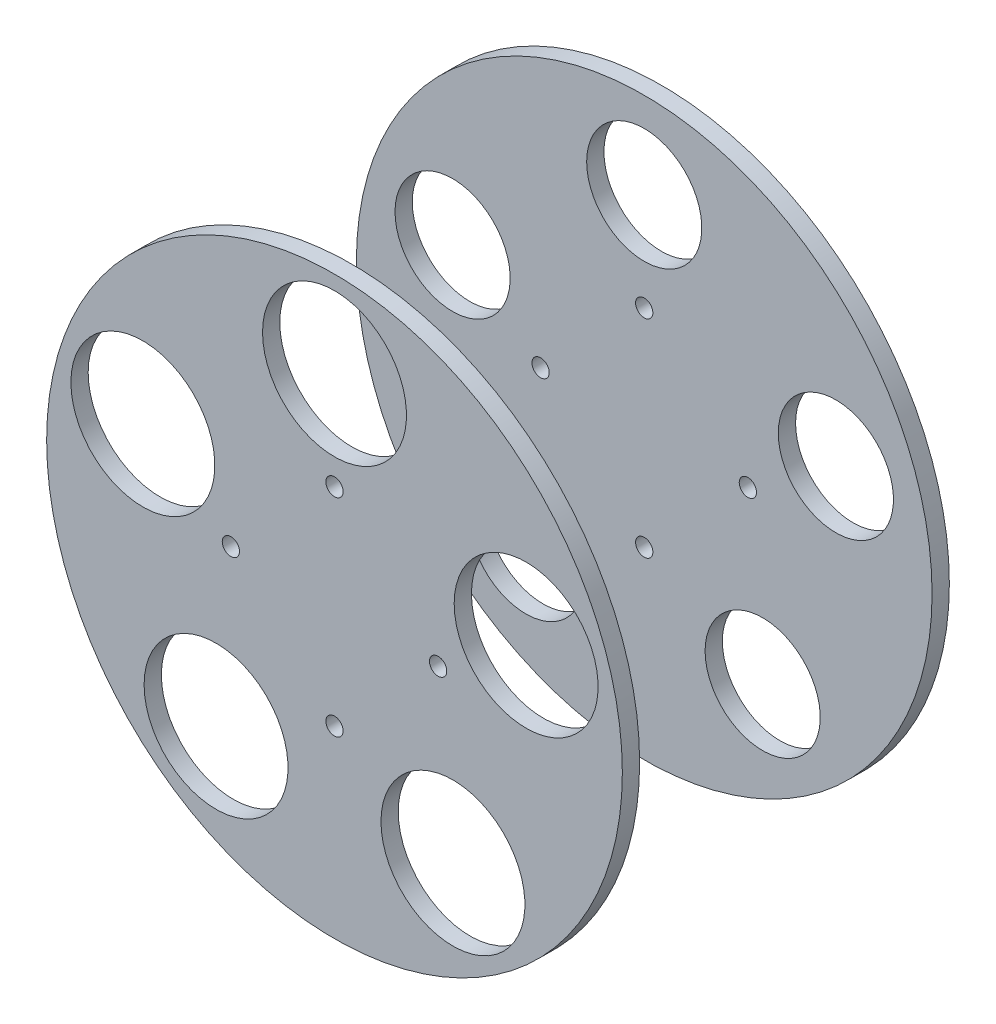
ISO-10303-21;
HEADER;
FILE_DESCRIPTION(('STEP AP214'),'2;1');
FILE_NAME('part.step','',(''),(''),'','','');
FILE_SCHEMA(('AUTOMOTIVE_DESIGN { 1 0 10303 214 1 1 1 1 }'));
ENDSEC;
DATA;
#1=APPLICATION_CONTEXT('core data for automotive mechanical design processes');
#2=APPLICATION_PROTOCOL_DEFINITION('international standard','automotive_design',2000,#1);
#3=PRODUCT_CONTEXT('',#1,'mechanical');
#4=PRODUCT('Part','Part','',(#3));
#5=PRODUCT_RELATED_PRODUCT_CATEGORY('part','',(#4));
#6=PRODUCT_DEFINITION_FORMATION('','',#4);
#7=PRODUCT_DEFINITION_CONTEXT('part definition',#1,'design');
#8=PRODUCT_DEFINITION('design','',#6,#7);
#9=PRODUCT_DEFINITION_SHAPE('','',#8);
#10=(LENGTH_UNIT() NAMED_UNIT(*) SI_UNIT(.MILLI.,.METRE.));
#11=(NAMED_UNIT(*) PLANE_ANGLE_UNIT() SI_UNIT($,.RADIAN.));
#12=(NAMED_UNIT(*) SI_UNIT($,.STERADIAN.) SOLID_ANGLE_UNIT());
#13=UNCERTAINTY_MEASURE_WITH_UNIT(LENGTH_MEASURE(1.E-05),#10,'distance_accuracy_value','');
#14=(GEOMETRIC_REPRESENTATION_CONTEXT(3) GLOBAL_UNCERTAINTY_ASSIGNED_CONTEXT((#13)) GLOBAL_UNIT_ASSIGNED_CONTEXT((#10,
#11,#12)) REPRESENTATION_CONTEXT('',''));
#15=CARTESIAN_POINT('',(0.,0.,0.));
#16=DIRECTION('',(0.,0.,1.));
#17=DIRECTION('',(1.,0.,0.));
#18=AXIS2_PLACEMENT_3D('',#15,#16,#17);
#19=CARTESIAN_POINT('',(0.,0.,0.));
#20=DIRECTION('',(0.,0.,1.));
#21=DIRECTION('',(1.,0.,0.));
#22=AXIS2_PLACEMENT_3D('',#19,#20,#21);
#23=PLANE('',#22);
#24=CARTESIAN_POINT('',(0.,18.,0.));
#25=DIRECTION('',(0.,0.,-1.));
#26=DIRECTION('',(1.,0.,0.));
#27=AXIS2_PLACEMENT_3D('',#24,#25,#26);
#28=CIRCLE('',#27,1.5);
#29=CARTESIAN_POINT('',(-1.5,18.,0.));
#30=VERTEX_POINT('',#29);
#31=EDGE_CURVE('P0_E125',#30,#30,#28,.T.);
#32=ORIENTED_EDGE('',*,*,#31,.F.);
#33=EDGE_LOOP('',(#32));
#34=FACE_BOUND('',#33,.T.);
#35=CARTESIAN_POINT('',(0.,-18.,0.));
#36=DIRECTION('',(0.,0.,-1.));
#37=DIRECTION('',(1.,0.,0.));
#38=AXIS2_PLACEMENT_3D('',#35,#36,#37);
#39=CIRCLE('',#38,1.5);
#40=CARTESIAN_POINT('',(-1.5,-18.,0.));
#41=VERTEX_POINT('',#40);
#42=EDGE_CURVE('P0_E136',#41,#41,#39,.T.);
#43=ORIENTED_EDGE('',*,*,#42,.F.);
#44=EDGE_LOOP('',(#43));
#45=FACE_BOUND('',#44,.T.);
#46=CARTESIAN_POINT('',(33.2869780703304,10.8155948031231,0.));
#47=DIRECTION('',(0.,0.,-1.));
#48=DIRECTION('',(1.,0.,0.));
#49=AXIS2_PLACEMENT_3D('',#46,#47,#48);
#50=CIRCLE('',#49,12.5);
#51=CARTESIAN_POINT('',(20.7869780703304,10.8155948031231,0.));
#52=VERTEX_POINT('',#51);
#53=EDGE_CURVE('P0_E157',#52,#52,#50,.T.);
#54=ORIENTED_EDGE('',*,*,#53,.F.);
#55=EDGE_LOOP('',(#54));
#56=FACE_BOUND('',#55,.T.);
#57=CARTESIAN_POINT('',(20.5724838302366,-28.3155948031232,0.));
#58=DIRECTION('',(0.,0.,-1.));
#59=DIRECTION('',(1.,0.,0.));
#60=AXIS2_PLACEMENT_3D('',#57,#58,#59);
#61=CIRCLE('',#60,12.5);
#62=CARTESIAN_POINT('',(8.07248383023655,-28.3155948031232,0.));
#63=VERTEX_POINT('',#62);
#64=EDGE_CURVE('P0_E204',#63,#63,#61,.T.);
#65=ORIENTED_EDGE('',*,*,#64,.F.);
#66=EDGE_LOOP('',(#65));
#67=FACE_BOUND('',#66,.T.);
#68=CARTESIAN_POINT('',(18.,0.,0.));
#69=DIRECTION('',(0.,0.,-1.));
#70=DIRECTION('',(1.,0.,0.));
#71=AXIS2_PLACEMENT_3D('',#68,#69,#70);
#72=CIRCLE('',#71,1.5);
#73=CARTESIAN_POINT('',(16.5,0.,0.));
#74=VERTEX_POINT('',#73);
#75=EDGE_CURVE('P0_E80',#74,#74,#72,.T.);
#76=ORIENTED_EDGE('',*,*,#75,.F.);
#77=EDGE_LOOP('',(#76));
#78=FACE_BOUND('',#77,.T.);
#79=CARTESIAN_POINT('',(-18.,0.,0.));
#80=DIRECTION('',(0.,0.,-1.));
#81=DIRECTION('',(1.,0.,0.));
#82=AXIS2_PLACEMENT_3D('',#79,#80,#81);
#83=CIRCLE('',#82,1.5);
#84=CARTESIAN_POINT('',(-19.5,0.,0.));
#85=VERTEX_POINT('',#84);
#86=EDGE_CURVE('P0_E178',#85,#85,#83,.T.);
#87=ORIENTED_EDGE('',*,*,#86,.F.);
#88=EDGE_LOOP('',(#87));
#89=FACE_BOUND('',#88,.T.);
#90=CARTESIAN_POINT('',(-20.5724838302366,-28.3155948031232,0.));
#91=DIRECTION('',(0.,0.,-1.));
#92=DIRECTION('',(1.,0.,0.));
#93=AXIS2_PLACEMENT_3D('',#90,#91,#92);
#94=CIRCLE('',#93,12.5);
#95=CARTESIAN_POINT('',(-33.0724838302366,-28.3155948031232,0.));
#96=VERTEX_POINT('',#95);
#97=EDGE_CURVE('P0_E161',#96,#96,#94,.T.);
#98=ORIENTED_EDGE('',*,*,#97,.F.);
#99=EDGE_LOOP('',(#98));
#100=FACE_BOUND('',#99,.T.);
#101=CARTESIAN_POINT('',(-33.2869780703304,10.8155948031232,0.));
#102=DIRECTION('',(0.,0.,-1.));
#103=DIRECTION('',(1.,0.,0.));
#104=AXIS2_PLACEMENT_3D('',#101,#102,#103);
#105=CIRCLE('',#104,12.5);
#106=CARTESIAN_POINT('',(-45.7869780703304,10.8155948031232,0.));
#107=VERTEX_POINT('',#106);
#108=EDGE_CURVE('P0_E104',#107,#107,#105,.T.);
#109=ORIENTED_EDGE('',*,*,#108,.F.);
#110=EDGE_LOOP('',(#109));
#111=FACE_BOUND('',#110,.T.);
#112=CARTESIAN_POINT('',(0.,35.,0.));
#113=DIRECTION('',(0.,0.,-1.));
#114=DIRECTION('',(1.,0.,0.));
#115=AXIS2_PLACEMENT_3D('',#112,#113,#114);
#116=CIRCLE('',#115,12.5);
#117=CARTESIAN_POINT('',(-12.5,35.,0.));
#118=VERTEX_POINT('',#117);
#119=EDGE_CURVE('P0_E164',#118,#118,#116,.T.);
#120=ORIENTED_EDGE('',*,*,#119,.F.);
#121=EDGE_LOOP('',(#120));
#122=FACE_BOUND('',#121,.T.);
#123=CARTESIAN_POINT('',(0.,0.,0.));
#124=DIRECTION('',(0.,0.,1.));
#125=DIRECTION('',(1.,0.,0.));
#126=AXIS2_PLACEMENT_3D('',#123,#124,#125);
#127=CIRCLE('',#126,50.);
#128=CARTESIAN_POINT('',(-50.,0.,0.));
#129=VERTEX_POINT('',#128);
#130=EDGE_CURVE('P0_E11',#129,#129,#127,.T.);
#131=ORIENTED_EDGE('',*,*,#130,.F.);
#132=EDGE_LOOP('',(#131));
#133=FACE_BOUND('',#132,.T.);
#134=ADVANCED_FACE('P0_F17',(#34,#45,#56,#67,#78,#89,#100,#111,#122,#133),#23,.F.);
#135=CARTESIAN_POINT('',(0.,0.,3.));
#136=DIRECTION('',(0.,0.,1.));
#137=DIRECTION('',(1.,0.,0.));
#138=AXIS2_PLACEMENT_3D('',#135,#136,#137);
#139=PLANE('',#138);
#140=CARTESIAN_POINT('',(0.,18.,3.));
#141=DIRECTION('',(0.,0.,-1.));
#142=DIRECTION('',(1.,0.,0.));
#143=AXIS2_PLACEMENT_3D('',#140,#141,#142);
#144=CIRCLE('',#143,1.5);
#145=CARTESIAN_POINT('',(-1.5,18.,3.));
#146=VERTEX_POINT('',#145);
#147=EDGE_CURVE('P0_E214',#146,#146,#144,.T.);
#148=ORIENTED_EDGE('',*,*,#147,.T.);
#149=EDGE_LOOP('',(#148));
#150=FACE_BOUND('',#149,.T.);
#151=CARTESIAN_POINT('',(0.,-18.,3.));
#152=DIRECTION('',(0.,0.,-1.));
#153=DIRECTION('',(1.,0.,0.));
#154=AXIS2_PLACEMENT_3D('',#151,#152,#153);
#155=CIRCLE('',#154,1.5);
#156=CARTESIAN_POINT('',(-1.5,-18.,3.));
#157=VERTEX_POINT('',#156);
#158=EDGE_CURVE('P0_E134',#157,#157,#155,.T.);
#159=ORIENTED_EDGE('',*,*,#158,.T.);
#160=EDGE_LOOP('',(#159));
#161=FACE_BOUND('',#160,.T.);
#162=CARTESIAN_POINT('',(33.2869780703304,10.8155948031231,3.));
#163=DIRECTION('',(0.,0.,-1.));
#164=DIRECTION('',(1.,0.,0.));
#165=AXIS2_PLACEMENT_3D('',#162,#163,#164);
#166=CIRCLE('',#165,12.5);
#167=CARTESIAN_POINT('',(20.7869780703304,10.8155948031231,3.));
#168=VERTEX_POINT('',#167);
#169=EDGE_CURVE('P0_E189',#168,#168,#166,.T.);
#170=ORIENTED_EDGE('',*,*,#169,.T.);
#171=EDGE_LOOP('',(#170));
#172=FACE_BOUND('',#171,.T.);
#173=CARTESIAN_POINT('',(20.5724838302366,-28.3155948031232,3.));
#174=DIRECTION('',(0.,0.,-1.));
#175=DIRECTION('',(1.,0.,0.));
#176=AXIS2_PLACEMENT_3D('',#173,#174,#175);
#177=CIRCLE('',#176,12.5);
#178=CARTESIAN_POINT('',(8.07248383023655,-28.3155948031232,3.));
#179=VERTEX_POINT('',#178);
#180=EDGE_CURVE('P0_E153',#179,#179,#177,.T.);
#181=ORIENTED_EDGE('',*,*,#180,.T.);
#182=EDGE_LOOP('',(#181));
#183=FACE_BOUND('',#182,.T.);
#184=CARTESIAN_POINT('',(18.,0.,3.));
#185=DIRECTION('',(0.,0.,-1.));
#186=DIRECTION('',(1.,0.,0.));
#187=AXIS2_PLACEMENT_3D('',#184,#185,#186);
#188=CIRCLE('',#187,1.5);
#189=CARTESIAN_POINT('',(16.5,0.,3.));
#190=VERTEX_POINT('',#189);
#191=EDGE_CURVE('P0_E207',#190,#190,#188,.T.);
#192=ORIENTED_EDGE('',*,*,#191,.T.);
#193=EDGE_LOOP('',(#192));
#194=FACE_BOUND('',#193,.T.);
#195=CARTESIAN_POINT('',(-18.,0.,3.));
#196=DIRECTION('',(0.,0.,-1.));
#197=DIRECTION('',(1.,0.,0.));
#198=AXIS2_PLACEMENT_3D('',#195,#196,#197);
#199=CIRCLE('',#198,1.5);
#200=CARTESIAN_POINT('',(-19.5,0.,3.));
#201=VERTEX_POINT('',#200);
#202=EDGE_CURVE('P0_E179',#201,#201,#199,.T.);
#203=ORIENTED_EDGE('',*,*,#202,.T.);
#204=EDGE_LOOP('',(#203));
#205=FACE_BOUND('',#204,.T.);
#206=CARTESIAN_POINT('',(-20.5724838302366,-28.3155948031232,3.));
#207=DIRECTION('',(0.,0.,-1.));
#208=DIRECTION('',(1.,0.,0.));
#209=AXIS2_PLACEMENT_3D('',#206,#207,#208);
#210=CIRCLE('',#209,12.5);
#211=CARTESIAN_POINT('',(-33.0724838302366,-28.3155948031231,3.));
#212=VERTEX_POINT('',#211);
#213=EDGE_CURVE('P0_E162',#212,#212,#210,.T.);
#214=ORIENTED_EDGE('',*,*,#213,.T.);
#215=EDGE_LOOP('',(#214));
#216=FACE_BOUND('',#215,.T.);
#217=CARTESIAN_POINT('',(-33.2869780703304,10.8155948031232,3.));
#218=DIRECTION('',(0.,0.,-1.));
#219=DIRECTION('',(1.,0.,0.));
#220=AXIS2_PLACEMENT_3D('',#217,#218,#219);
#221=CIRCLE('',#220,12.5);
#222=CARTESIAN_POINT('',(-45.7869780703304,10.8155948031232,3.));
#223=VERTEX_POINT('',#222);
#224=EDGE_CURVE('P0_E173',#223,#223,#221,.T.);
#225=ORIENTED_EDGE('',*,*,#224,.T.);
#226=EDGE_LOOP('',(#225));
#227=FACE_BOUND('',#226,.T.);
#228=CARTESIAN_POINT('',(0.,35.,3.));
#229=DIRECTION('',(0.,0.,-1.));
#230=DIRECTION('',(1.,0.,0.));
#231=AXIS2_PLACEMENT_3D('',#228,#229,#230);
#232=CIRCLE('',#231,12.5);
#233=CARTESIAN_POINT('',(-12.5,35.,3.));
#234=VERTEX_POINT('',#233);
#235=EDGE_CURVE('P0_E185',#234,#234,#232,.T.);
#236=ORIENTED_EDGE('',*,*,#235,.T.);
#237=EDGE_LOOP('',(#236));
#238=FACE_BOUND('',#237,.T.);
#239=CARTESIAN_POINT('',(0.,0.,3.));
#240=DIRECTION('',(0.,0.,1.));
#241=DIRECTION('',(1.,0.,0.));
#242=AXIS2_PLACEMENT_3D('',#239,#240,#241);
#243=CIRCLE('',#242,50.);
#244=CARTESIAN_POINT('',(-50.,0.,3.));
#245=VERTEX_POINT('',#244);
#246=EDGE_CURVE('P0_E167',#245,#245,#243,.T.);
#247=ORIENTED_EDGE('',*,*,#246,.T.);
#248=EDGE_LOOP('',(#247));
#249=FACE_BOUND('',#248,.T.);
#250=ADVANCED_FACE('P0_F140',(#150,#161,#172,#183,#194,#205,#216,#227,#238,#249),#139,.T.);
#251=CARTESIAN_POINT('',(0.,0.,0.));
#252=DIRECTION('',(0.,0.,1.));
#253=DIRECTION('',(1.,0.,0.));
#254=AXIS2_PLACEMENT_3D('',#251,#252,#253);
#255=CYLINDRICAL_SURFACE('',#254,50.);
#256=ORIENTED_EDGE('',*,*,#246,.F.);
#257=DIRECTION('',(0.,0.,-1.));
#258=VECTOR('',#257,1.);
#259=CARTESIAN_POINT('',(-50.,0.,0.));
#260=LINE('',#259,#258);
#261=EDGE_CURVE('P0_E28',#245,#129,#260,.T.);
#262=ORIENTED_EDGE('',*,*,#261,.T.);
#263=ORIENTED_EDGE('',*,*,#130,.T.);
#264=ORIENTED_EDGE('',*,*,#261,.F.);
#265=EDGE_LOOP('',(#256,#262,#263,#264));
#266=FACE_BOUND('',#265,.T.);
#267=ADVANCED_FACE('P0_F240',(#266),#255,.T.);
#268=CARTESIAN_POINT('',(0.,35.,0.));
#269=DIRECTION('',(0.,0.,1.));
#270=DIRECTION('',(1.,0.,0.));
#271=AXIS2_PLACEMENT_3D('',#268,#269,#270);
#272=CYLINDRICAL_SURFACE('',#271,12.5);
#273=ORIENTED_EDGE('',*,*,#235,.F.);
#274=DIRECTION('',(0.,0.,-1.));
#275=VECTOR('',#274,1.);
#276=CARTESIAN_POINT('',(-12.5,35.,0.));
#277=LINE('',#276,#275);
#278=EDGE_CURVE('P0_E93',#234,#118,#277,.T.);
#279=ORIENTED_EDGE('',*,*,#278,.T.);
#280=ORIENTED_EDGE('',*,*,#119,.T.);
#281=ORIENTED_EDGE('',*,*,#278,.F.);
#282=EDGE_LOOP('',(#273,#279,#280,#281));
#283=FACE_BOUND('',#282,.T.);
#284=ADVANCED_FACE('P0_F19',(#283),#272,.F.);
#285=CARTESIAN_POINT('',(-33.2869780703304,10.8155948031232,0.));
#286=DIRECTION('',(0.,0.,1.));
#287=DIRECTION('',(1.,0.,0.));
#288=AXIS2_PLACEMENT_3D('',#285,#286,#287);
#289=CYLINDRICAL_SURFACE('',#288,12.5);
#290=ORIENTED_EDGE('',*,*,#224,.F.);
#291=DIRECTION('',(0.,0.,-1.));
#292=VECTOR('',#291,1.);
#293=CARTESIAN_POINT('',(-45.7869780703304,10.8155948031232,0.));
#294=LINE('',#293,#292);
#295=EDGE_CURVE('P0_E186',#223,#107,#294,.T.);
#296=ORIENTED_EDGE('',*,*,#295,.T.);
#297=ORIENTED_EDGE('',*,*,#108,.T.);
#298=ORIENTED_EDGE('',*,*,#295,.F.);
#299=EDGE_LOOP('',(#290,#296,#297,#298));
#300=FACE_BOUND('',#299,.T.);
#301=ADVANCED_FACE('P0_F246',(#300),#289,.F.);
#302=CARTESIAN_POINT('',(-20.5724838302366,-28.3155948031232,0.));
#303=DIRECTION('',(0.,0.,1.));
#304=DIRECTION('',(1.,0.,0.));
#305=AXIS2_PLACEMENT_3D('',#302,#303,#304);
#306=CYLINDRICAL_SURFACE('',#305,12.5);
#307=ORIENTED_EDGE('',*,*,#213,.F.);
#308=DIRECTION('',(0.,0.,-1.));
#309=VECTOR('',#308,1.);
#310=CARTESIAN_POINT('',(-33.0724838302366,-28.3155948031232,0.));
#311=LINE('',#310,#309);
#312=EDGE_CURVE('P0_E158',#212,#96,#311,.T.);
#313=ORIENTED_EDGE('',*,*,#312,.T.);
#314=ORIENTED_EDGE('',*,*,#97,.T.);
#315=ORIENTED_EDGE('',*,*,#312,.F.);
#316=EDGE_LOOP('',(#307,#313,#314,#315));
#317=FACE_BOUND('',#316,.T.);
#318=ADVANCED_FACE('P0_F249',(#317),#306,.F.);
#319=CARTESIAN_POINT('',(-18.,0.,0.));
#320=DIRECTION('',(0.,0.,1.));
#321=DIRECTION('',(1.,0.,0.));
#322=AXIS2_PLACEMENT_3D('',#319,#320,#321);
#323=CYLINDRICAL_SURFACE('',#322,1.5);
#324=ORIENTED_EDGE('',*,*,#202,.F.);
#325=DIRECTION('',(0.,0.,-1.));
#326=VECTOR('',#325,1.);
#327=CARTESIAN_POINT('',(-19.5,0.,0.));
#328=LINE('',#327,#326);
#329=EDGE_CURVE('P0_E174',#201,#85,#328,.T.);
#330=ORIENTED_EDGE('',*,*,#329,.T.);
#331=ORIENTED_EDGE('',*,*,#86,.T.);
#332=ORIENTED_EDGE('',*,*,#329,.F.);
#333=EDGE_LOOP('',(#324,#330,#331,#332));
#334=FACE_BOUND('',#333,.T.);
#335=ADVANCED_FACE('P0_F243',(#334),#323,.F.);
#336=CARTESIAN_POINT('',(18.,0.,0.));
#337=DIRECTION('',(0.,0.,1.));
#338=DIRECTION('',(1.,0.,0.));
#339=AXIS2_PLACEMENT_3D('',#336,#337,#338);
#340=CYLINDRICAL_SURFACE('',#339,1.5);
#341=ORIENTED_EDGE('',*,*,#191,.F.);
#342=DIRECTION('',(0.,0.,-1.));
#343=VECTOR('',#342,1.);
#344=CARTESIAN_POINT('',(16.5,0.,0.));
#345=LINE('',#344,#343);
#346=EDGE_CURVE('P0_E21',#190,#74,#345,.T.);
#347=ORIENTED_EDGE('',*,*,#346,.T.);
#348=ORIENTED_EDGE('',*,*,#75,.T.);
#349=ORIENTED_EDGE('',*,*,#346,.F.);
#350=EDGE_LOOP('',(#341,#347,#348,#349));
#351=FACE_BOUND('',#350,.T.);
#352=ADVANCED_FACE('P0_F250',(#351),#340,.F.);
#353=CARTESIAN_POINT('',(20.5724838302366,-28.3155948031232,0.));
#354=DIRECTION('',(0.,0.,1.));
#355=DIRECTION('',(1.,0.,0.));
#356=AXIS2_PLACEMENT_3D('',#353,#354,#355);
#357=CYLINDRICAL_SURFACE('',#356,12.5);
#358=ORIENTED_EDGE('',*,*,#180,.F.);
#359=DIRECTION('',(0.,0.,-1.));
#360=VECTOR('',#359,1.);
#361=CARTESIAN_POINT('',(8.07248383023655,-28.3155948031232,0.));
#362=LINE('',#361,#360);
#363=EDGE_CURVE('P0_E156',#179,#63,#362,.T.);
#364=ORIENTED_EDGE('',*,*,#363,.T.);
#365=ORIENTED_EDGE('',*,*,#64,.T.);
#366=ORIENTED_EDGE('',*,*,#363,.F.);
#367=EDGE_LOOP('',(#358,#364,#365,#366));
#368=FACE_BOUND('',#367,.T.);
#369=ADVANCED_FACE('P0_F252',(#368),#357,.F.);
#370=CARTESIAN_POINT('',(33.2869780703304,10.8155948031231,0.));
#371=DIRECTION('',(0.,0.,1.));
#372=DIRECTION('',(1.,0.,0.));
#373=AXIS2_PLACEMENT_3D('',#370,#371,#372);
#374=CYLINDRICAL_SURFACE('',#373,12.5);
#375=ORIENTED_EDGE('',*,*,#169,.F.);
#376=DIRECTION('',(0.,0.,-1.));
#377=VECTOR('',#376,1.);
#378=CARTESIAN_POINT('',(20.7869780703304,10.8155948031231,0.));
#379=LINE('',#378,#377);
#380=EDGE_CURVE('P0_E193',#168,#52,#379,.T.);
#381=ORIENTED_EDGE('',*,*,#380,.T.);
#382=ORIENTED_EDGE('',*,*,#53,.T.);
#383=ORIENTED_EDGE('',*,*,#380,.F.);
#384=EDGE_LOOP('',(#375,#381,#382,#383));
#385=FACE_BOUND('',#384,.T.);
#386=ADVANCED_FACE('P0_F230',(#385),#374,.F.);
#387=CARTESIAN_POINT('',(0.,-18.,0.));
#388=DIRECTION('',(0.,0.,1.));
#389=DIRECTION('',(1.,0.,0.));
#390=AXIS2_PLACEMENT_3D('',#387,#388,#389);
#391=CYLINDRICAL_SURFACE('',#390,1.5);
#392=ORIENTED_EDGE('',*,*,#158,.F.);
#393=DIRECTION('',(0.,0.,-1.));
#394=VECTOR('',#393,1.);
#395=CARTESIAN_POINT('',(-1.5,-18.,0.));
#396=LINE('',#395,#394);
#397=EDGE_CURVE('P0_E131',#157,#41,#396,.T.);
#398=ORIENTED_EDGE('',*,*,#397,.T.);
#399=ORIENTED_EDGE('',*,*,#42,.T.);
#400=ORIENTED_EDGE('',*,*,#397,.F.);
#401=EDGE_LOOP('',(#392,#398,#399,#400));
#402=FACE_BOUND('',#401,.T.);
#403=ADVANCED_FACE('P0_F133',(#402),#391,.F.);
#404=CARTESIAN_POINT('',(0.,18.,0.));
#405=DIRECTION('',(0.,0.,1.));
#406=DIRECTION('',(1.,0.,0.));
#407=AXIS2_PLACEMENT_3D('',#404,#405,#406);
#408=CYLINDRICAL_SURFACE('',#407,1.5);
#409=ORIENTED_EDGE('',*,*,#147,.F.);
#410=DIRECTION('',(0.,0.,-1.));
#411=VECTOR('',#410,1.);
#412=CARTESIAN_POINT('',(-1.5,18.,0.));
#413=LINE('',#412,#411);
#414=EDGE_CURVE('P0_E148',#146,#30,#413,.T.);
#415=ORIENTED_EDGE('',*,*,#414,.T.);
#416=ORIENTED_EDGE('',*,*,#31,.T.);
#417=ORIENTED_EDGE('',*,*,#414,.F.);
#418=EDGE_LOOP('',(#409,#415,#416,#417));
#419=FACE_BOUND('',#418,.T.);
#420=ADVANCED_FACE('P0_F223',(#419),#408,.F.);
#421=CLOSED_SHELL('',(#134,#250,#267,#284,#301,#318,#335,#352,#369,#386,#403,#420));
#422=MANIFOLD_SOLID_BREP('P0_B1',#421);
#423=CARTESIAN_POINT('',(0.,0.,-53.8));
#424=DIRECTION('',(0.,0.,1.));
#425=DIRECTION('',(1.,0.,0.));
#426=AXIS2_PLACEMENT_3D('',#423,#424,#425);
#427=PLANE('',#426);
#428=CARTESIAN_POINT('',(0.,18.,-53.8));
#429=DIRECTION('',(0.,0.,-1.));
#430=DIRECTION('',(1.,0.,0.));
#431=AXIS2_PLACEMENT_3D('',#428,#429,#430);
#432=CIRCLE('',#431,1.5);
#433=CARTESIAN_POINT('',(-1.5,18.,-53.8));
#434=VERTEX_POINT('',#433);
#435=EDGE_CURVE('P1_E201',#434,#434,#432,.T.);
#436=ORIENTED_EDGE('',*,*,#435,.F.);
#437=EDGE_LOOP('',(#436));
#438=FACE_BOUND('',#437,.T.);
#439=CARTESIAN_POINT('',(0.,-18.,-53.8));
#440=DIRECTION('',(0.,0.,-1.));
#441=DIRECTION('',(1.,0.,0.));
#442=AXIS2_PLACEMENT_3D('',#439,#440,#441);
#443=CIRCLE('',#442,1.5);
#444=CARTESIAN_POINT('',(-1.5,-18.,-53.8));
#445=VERTEX_POINT('',#444);
#446=EDGE_CURVE('P1_E183',#445,#445,#443,.T.);
#447=ORIENTED_EDGE('',*,*,#446,.F.);
#448=EDGE_LOOP('',(#447));
#449=FACE_BOUND('',#448,.T.);
#450=CARTESIAN_POINT('',(33.2869780703304,10.8155948031231,-53.8));
#451=DIRECTION('',(0.,0.,-1.));
#452=DIRECTION('',(1.,0.,0.));
#453=AXIS2_PLACEMENT_3D('',#450,#451,#452);
#454=CIRCLE('',#453,10.);
#455=CARTESIAN_POINT('',(23.2869780703304,10.8155948031231,-53.8));
#456=VERTEX_POINT('',#455);
#457=EDGE_CURVE('P1_E133',#456,#456,#454,.T.);
#458=ORIENTED_EDGE('',*,*,#457,.F.);
#459=EDGE_LOOP('',(#458));
#460=FACE_BOUND('',#459,.T.);
#461=CARTESIAN_POINT('',(20.5724838302366,-28.3155948031232,-53.8));
#462=DIRECTION('',(0.,0.,-1.));
#463=DIRECTION('',(1.,0.,0.));
#464=AXIS2_PLACEMENT_3D('',#461,#462,#463);
#465=CIRCLE('',#464,10.);
#466=CARTESIAN_POINT('',(10.5724838302366,-28.3155948031232,-53.8));
#467=VERTEX_POINT('',#466);
#468=EDGE_CURVE('P1_E165',#467,#467,#465,.T.);
#469=ORIENTED_EDGE('',*,*,#468,.F.);
#470=EDGE_LOOP('',(#469));
#471=FACE_BOUND('',#470,.T.);
#472=CARTESIAN_POINT('',(18.,0.,-53.8));
#473=DIRECTION('',(0.,0.,-1.));
#474=DIRECTION('',(1.,0.,0.));
#475=AXIS2_PLACEMENT_3D('',#472,#473,#474);
#476=CIRCLE('',#475,1.5);
#477=CARTESIAN_POINT('',(16.5,0.,-53.8));
#478=VERTEX_POINT('',#477);
#479=EDGE_CURVE('P1_E78',#478,#478,#476,.T.);
#480=ORIENTED_EDGE('',*,*,#479,.F.);
#481=EDGE_LOOP('',(#480));
#482=FACE_BOUND('',#481,.T.);
#483=CARTESIAN_POINT('',(-18.,0.,-53.8));
#484=DIRECTION('',(0.,0.,-1.));
#485=DIRECTION('',(1.,0.,0.));
#486=AXIS2_PLACEMENT_3D('',#483,#484,#485);
#487=CIRCLE('',#486,1.5);
#488=CARTESIAN_POINT('',(-19.5,0.,-53.8));
#489=VERTEX_POINT('',#488);
#490=EDGE_CURVE('P1_E181',#489,#489,#487,.T.);
#491=ORIENTED_EDGE('',*,*,#490,.F.);
#492=EDGE_LOOP('',(#491));
#493=FACE_BOUND('',#492,.T.);
#494=CARTESIAN_POINT('',(-20.5724838302366,-28.3155948031232,-53.8));
#495=DIRECTION('',(0.,0.,-1.));
#496=DIRECTION('',(1.,0.,0.));
#497=AXIS2_PLACEMENT_3D('',#494,#495,#496);
#498=CIRCLE('',#497,10.);
#499=CARTESIAN_POINT('',(-30.5724838302366,-28.3155948031232,-53.8));
#500=VERTEX_POINT('',#499);
#501=EDGE_CURVE('P1_E100',#500,#500,#498,.T.);
#502=ORIENTED_EDGE('',*,*,#501,.F.);
#503=EDGE_LOOP('',(#502));
#504=FACE_BOUND('',#503,.T.);
#505=CARTESIAN_POINT('',(-33.2869780703304,10.8155948031232,-53.8));
#506=DIRECTION('',(0.,0.,-1.));
#507=DIRECTION('',(1.,0.,0.));
#508=AXIS2_PLACEMENT_3D('',#505,#506,#507);
#509=CIRCLE('',#508,10.);
#510=CARTESIAN_POINT('',(-43.2869780703304,10.8155948031232,-53.8));
#511=VERTEX_POINT('',#510);
#512=EDGE_CURVE('P1_E176',#511,#511,#509,.T.);
#513=ORIENTED_EDGE('',*,*,#512,.F.);
#514=EDGE_LOOP('',(#513));
#515=FACE_BOUND('',#514,.T.);
#516=CARTESIAN_POINT('',(0.,35.,-53.8));
#517=DIRECTION('',(0.,0.,-1.));
#518=DIRECTION('',(1.,0.,0.));
#519=AXIS2_PLACEMENT_3D('',#516,#517,#518);
#520=CIRCLE('',#519,10.);
#521=CARTESIAN_POINT('',(-10.,35.,-53.8));
#522=VERTEX_POINT('',#521);
#523=EDGE_CURVE('P1_E210',#522,#522,#520,.T.);
#524=ORIENTED_EDGE('',*,*,#523,.F.);
#525=EDGE_LOOP('',(#524));
#526=FACE_BOUND('',#525,.T.);
#527=CARTESIAN_POINT('',(0.,0.,-53.8));
#528=DIRECTION('',(0.,0.,1.));
#529=DIRECTION('',(1.,0.,0.));
#530=AXIS2_PLACEMENT_3D('',#527,#528,#529);
#531=CIRCLE('',#530,50.);
#532=CARTESIAN_POINT('',(-50.,0.,-53.8));
#533=VERTEX_POINT('',#532);
#534=EDGE_CURVE('P1_E11',#533,#533,#531,.T.);
#535=ORIENTED_EDGE('',*,*,#534,.F.);
#536=EDGE_LOOP('',(#535));
#537=FACE_BOUND('',#536,.T.);
#538=ADVANCED_FACE('P1_F17',(#438,#449,#460,#471,#482,#493,#504,#515,#526,#537),#427,.F.);
#539=CARTESIAN_POINT('',(0.,0.,-50.8));
#540=DIRECTION('',(0.,0.,1.));
#541=DIRECTION('',(1.,0.,0.));
#542=AXIS2_PLACEMENT_3D('',#539,#540,#541);
#543=PLANE('',#542);
#544=CARTESIAN_POINT('',(0.,18.,-50.8));
#545=DIRECTION('',(0.,0.,-1.));
#546=DIRECTION('',(1.,0.,0.));
#547=AXIS2_PLACEMENT_3D('',#544,#545,#546);
#548=CIRCLE('',#547,1.5);
#549=CARTESIAN_POINT('',(-1.5,18.,-50.8));
#550=VERTEX_POINT('',#549);
#551=EDGE_CURVE('P1_E219',#550,#550,#548,.T.);
#552=ORIENTED_EDGE('',*,*,#551,.T.);
#553=EDGE_LOOP('',(#552));
#554=FACE_BOUND('',#553,.T.);
#555=CARTESIAN_POINT('',(0.,-18.,-50.8));
#556=DIRECTION('',(0.,0.,-1.));
#557=DIRECTION('',(1.,0.,0.));
#558=AXIS2_PLACEMENT_3D('',#555,#556,#557);
#559=CIRCLE('',#558,1.5);
#560=CARTESIAN_POINT('',(-1.5,-18.,-50.8));
#561=VERTEX_POINT('',#560);
#562=EDGE_CURVE('P1_E194',#561,#561,#559,.T.);
#563=ORIENTED_EDGE('',*,*,#562,.T.);
#564=EDGE_LOOP('',(#563));
#565=FACE_BOUND('',#564,.T.);
#566=CARTESIAN_POINT('',(33.2869780703304,10.8155948031231,-50.8));
#567=DIRECTION('',(0.,0.,-1.));
#568=DIRECTION('',(1.,0.,0.));
#569=AXIS2_PLACEMENT_3D('',#566,#567,#568);
#570=CIRCLE('',#569,10.);
#571=CARTESIAN_POINT('',(23.2869780703304,10.8155948031231,-50.8));
#572=VERTEX_POINT('',#571);
#573=EDGE_CURVE('P1_E150',#572,#572,#570,.T.);
#574=ORIENTED_EDGE('',*,*,#573,.T.);
#575=EDGE_LOOP('',(#574));
#576=FACE_BOUND('',#575,.T.);
#577=CARTESIAN_POINT('',(20.5724838302366,-28.3155948031232,-50.8));
#578=DIRECTION('',(0.,0.,-1.));
#579=DIRECTION('',(1.,0.,0.));
#580=AXIS2_PLACEMENT_3D('',#577,#578,#579);
#581=CIRCLE('',#580,10.);
#582=CARTESIAN_POINT('',(10.5724838302366,-28.3155948031232,-50.8));
#583=VERTEX_POINT('',#582);
#584=EDGE_CURVE('P1_E140',#583,#583,#581,.T.);
#585=ORIENTED_EDGE('',*,*,#584,.T.);
#586=EDGE_LOOP('',(#585));
#587=FACE_BOUND('',#586,.T.);
#588=CARTESIAN_POINT('',(18.,0.,-50.8));
#589=DIRECTION('',(0.,0.,-1.));
#590=DIRECTION('',(1.,0.,0.));
#591=AXIS2_PLACEMENT_3D('',#588,#589,#590);
#592=CIRCLE('',#591,1.5);
#593=CARTESIAN_POINT('',(16.5,0.,-50.8));
#594=VERTEX_POINT('',#593);
#595=EDGE_CURVE('P1_E156',#594,#594,#592,.T.);
#596=ORIENTED_EDGE('',*,*,#595,.T.);
#597=EDGE_LOOP('',(#596));
#598=FACE_BOUND('',#597,.T.);
#599=CARTESIAN_POINT('',(-18.,0.,-50.8));
#600=DIRECTION('',(0.,0.,-1.));
#601=DIRECTION('',(1.,0.,0.));
#602=AXIS2_PLACEMENT_3D('',#599,#600,#601);
#603=CIRCLE('',#602,1.5);
#604=CARTESIAN_POINT('',(-19.5,0.,-50.8));
#605=VERTEX_POINT('',#604);
#606=EDGE_CURVE('P1_E161',#605,#605,#603,.T.);
#607=ORIENTED_EDGE('',*,*,#606,.T.);
#608=EDGE_LOOP('',(#607));
#609=FACE_BOUND('',#608,.T.);
#610=CARTESIAN_POINT('',(-20.5724838302366,-28.3155948031232,-50.8));
#611=DIRECTION('',(0.,0.,-1.));
#612=DIRECTION('',(1.,0.,0.));
#613=AXIS2_PLACEMENT_3D('',#610,#611,#612);
#614=CIRCLE('',#613,10.);
#615=CARTESIAN_POINT('',(-30.5724838302366,-28.3155948031232,-50.8));
#616=VERTEX_POINT('',#615);
#617=EDGE_CURVE('P1_E21',#616,#616,#614,.T.);
#618=ORIENTED_EDGE('',*,*,#617,.T.);
#619=EDGE_LOOP('',(#618));
#620=FACE_BOUND('',#619,.T.);
#621=CARTESIAN_POINT('',(-33.2869780703304,10.8155948031232,-50.8));
#622=DIRECTION('',(0.,0.,-1.));
#623=DIRECTION('',(1.,0.,0.));
#624=AXIS2_PLACEMENT_3D('',#621,#622,#623);
#625=CIRCLE('',#624,10.);
#626=CARTESIAN_POINT('',(-43.2869780703304,10.8155948031232,-50.8));
#627=VERTEX_POINT('',#626);
#628=EDGE_CURVE('P1_E153',#627,#627,#625,.T.);
#629=ORIENTED_EDGE('',*,*,#628,.T.);
#630=EDGE_LOOP('',(#629));
#631=FACE_BOUND('',#630,.T.);
#632=CARTESIAN_POINT('',(0.,35.,-50.8));
#633=DIRECTION('',(0.,0.,-1.));
#634=DIRECTION('',(1.,0.,0.));
#635=AXIS2_PLACEMENT_3D('',#632,#633,#634);
#636=CIRCLE('',#635,10.);
#637=CARTESIAN_POINT('',(-10.,35.,-50.8));
#638=VERTEX_POINT('',#637);
#639=EDGE_CURVE('P1_E179',#638,#638,#636,.T.);
#640=ORIENTED_EDGE('',*,*,#639,.T.);
#641=EDGE_LOOP('',(#640));
#642=FACE_BOUND('',#641,.T.);
#643=CARTESIAN_POINT('',(0.,0.,-50.8));
#644=DIRECTION('',(0.,0.,1.));
#645=DIRECTION('',(1.,0.,0.));
#646=AXIS2_PLACEMENT_3D('',#643,#644,#645);
#647=CIRCLE('',#646,50.);
#648=CARTESIAN_POINT('',(-50.,0.,-50.8));
#649=VERTEX_POINT('',#648);
#650=EDGE_CURVE('P1_E204',#649,#649,#647,.T.);
#651=ORIENTED_EDGE('',*,*,#650,.T.);
#652=EDGE_LOOP('',(#651));
#653=FACE_BOUND('',#652,.T.);
#654=ADVANCED_FACE('P1_F244',(#554,#565,#576,#587,#598,#609,#620,#631,#642,#653),#543,.T.);
#655=CARTESIAN_POINT('',(0.,0.,-53.8));
#656=DIRECTION('',(0.,0.,1.));
#657=DIRECTION('',(1.,0.,0.));
#658=AXIS2_PLACEMENT_3D('',#655,#656,#657);
#659=CYLINDRICAL_SURFACE('',#658,50.);
#660=ORIENTED_EDGE('',*,*,#650,.F.);
#661=DIRECTION('',(0.,0.,-1.));
#662=VECTOR('',#661,1.);
#663=CARTESIAN_POINT('',(-50.,0.,-53.8));
#664=LINE('',#663,#662);
#665=EDGE_CURVE('P1_E28',#649,#533,#664,.T.);
#666=ORIENTED_EDGE('',*,*,#665,.T.);
#667=ORIENTED_EDGE('',*,*,#534,.T.);
#668=ORIENTED_EDGE('',*,*,#665,.F.);
#669=EDGE_LOOP('',(#660,#666,#667,#668));
#670=FACE_BOUND('',#669,.T.);
#671=ADVANCED_FACE('P1_F269',(#670),#659,.T.);
#672=CARTESIAN_POINT('',(0.,35.,-53.8));
#673=DIRECTION('',(0.,0.,1.));
#674=DIRECTION('',(1.,0.,0.));
#675=AXIS2_PLACEMENT_3D('',#672,#673,#674);
#676=CYLINDRICAL_SURFACE('',#675,10.);
#677=ORIENTED_EDGE('',*,*,#639,.F.);
#678=DIRECTION('',(0.,0.,-1.));
#679=VECTOR('',#678,1.);
#680=CARTESIAN_POINT('',(-10.,35.,-53.8));
#681=LINE('',#680,#679);
#682=EDGE_CURVE('P1_E212',#638,#522,#681,.T.);
#683=ORIENTED_EDGE('',*,*,#682,.T.);
#684=ORIENTED_EDGE('',*,*,#523,.T.);
#685=ORIENTED_EDGE('',*,*,#682,.F.);
#686=EDGE_LOOP('',(#677,#683,#684,#685));
#687=FACE_BOUND('',#686,.T.);
#688=ADVANCED_FACE('P1_F258',(#687),#676,.F.);
#689=CARTESIAN_POINT('',(-33.2869780703304,10.8155948031232,-53.8));
#690=DIRECTION('',(0.,0.,1.));
#691=DIRECTION('',(1.,0.,0.));
#692=AXIS2_PLACEMENT_3D('',#689,#690,#691);
#693=CYLINDRICAL_SURFACE('',#692,10.);
#694=ORIENTED_EDGE('',*,*,#628,.F.);
#695=DIRECTION('',(0.,0.,-1.));
#696=VECTOR('',#695,1.);
#697=CARTESIAN_POINT('',(-43.2869780703304,10.8155948031232,-53.8));
#698=LINE('',#697,#696);
#699=EDGE_CURVE('P1_E180',#627,#511,#698,.T.);
#700=ORIENTED_EDGE('',*,*,#699,.T.);
#701=ORIENTED_EDGE('',*,*,#512,.T.);
#702=ORIENTED_EDGE('',*,*,#699,.F.);
#703=EDGE_LOOP('',(#694,#700,#701,#702));
#704=FACE_BOUND('',#703,.T.);
#705=ADVANCED_FACE('P1_F249',(#704),#693,.F.);
#706=CARTESIAN_POINT('',(-20.5724838302366,-28.3155948031232,-53.8));
#707=DIRECTION('',(0.,0.,1.));
#708=DIRECTION('',(1.,0.,0.));
#709=AXIS2_PLACEMENT_3D('',#706,#707,#708);
#710=CYLINDRICAL_SURFACE('',#709,10.);
#711=ORIENTED_EDGE('',*,*,#617,.F.);
#712=DIRECTION('',(0.,0.,-1.));
#713=VECTOR('',#712,1.);
#714=CARTESIAN_POINT('',(-30.5724838302366,-28.3155948031232,-53.8));
#715=LINE('',#714,#713);
#716=EDGE_CURVE('P1_E91',#616,#500,#715,.T.);
#717=ORIENTED_EDGE('',*,*,#716,.T.);
#718=ORIENTED_EDGE('',*,*,#501,.T.);
#719=ORIENTED_EDGE('',*,*,#716,.F.);
#720=EDGE_LOOP('',(#711,#717,#718,#719));
#721=FACE_BOUND('',#720,.T.);
#722=ADVANCED_FACE('P1_F246',(#721),#710,.F.);
#723=CARTESIAN_POINT('',(-18.,0.,-53.8));
#724=DIRECTION('',(0.,0.,1.));
#725=DIRECTION('',(1.,0.,0.));
#726=AXIS2_PLACEMENT_3D('',#723,#724,#725);
#727=CYLINDRICAL_SURFACE('',#726,1.5);
#728=ORIENTED_EDGE('',*,*,#606,.F.);
#729=DIRECTION('',(0.,0.,-1.));
#730=VECTOR('',#729,1.);
#731=CARTESIAN_POINT('',(-19.5,0.,-53.8));
#732=LINE('',#731,#730);
#733=EDGE_CURVE('P1_E62',#605,#489,#732,.T.);
#734=ORIENTED_EDGE('',*,*,#733,.T.);
#735=ORIENTED_EDGE('',*,*,#490,.T.);
#736=ORIENTED_EDGE('',*,*,#733,.F.);
#737=EDGE_LOOP('',(#728,#734,#735,#736));
#738=FACE_BOUND('',#737,.T.);
#739=ADVANCED_FACE('P1_F248',(#738),#727,.F.);
#740=CARTESIAN_POINT('',(18.,0.,-53.8));
#741=DIRECTION('',(0.,0.,1.));
#742=DIRECTION('',(1.,0.,0.));
#743=AXIS2_PLACEMENT_3D('',#740,#741,#742);
#744=CYLINDRICAL_SURFACE('',#743,1.5);
#745=ORIENTED_EDGE('',*,*,#595,.F.);
#746=DIRECTION('',(0.,0.,-1.));
#747=VECTOR('',#746,1.);
#748=CARTESIAN_POINT('',(16.5,0.,-53.8));
#749=LINE('',#748,#747);
#750=EDGE_CURVE('P1_E155',#594,#478,#749,.T.);
#751=ORIENTED_EDGE('',*,*,#750,.T.);
#752=ORIENTED_EDGE('',*,*,#479,.T.);
#753=ORIENTED_EDGE('',*,*,#750,.F.);
#754=EDGE_LOOP('',(#745,#751,#752,#753));
#755=FACE_BOUND('',#754,.T.);
#756=ADVANCED_FACE('P1_F256',(#755),#744,.F.);
#757=CARTESIAN_POINT('',(20.5724838302366,-28.3155948031232,-53.8));
#758=DIRECTION('',(0.,0.,1.));
#759=DIRECTION('',(1.,0.,0.));
#760=AXIS2_PLACEMENT_3D('',#757,#758,#759);
#761=CYLINDRICAL_SURFACE('',#760,10.);
#762=ORIENTED_EDGE('',*,*,#584,.F.);
#763=DIRECTION('',(0.,0.,-1.));
#764=VECTOR('',#763,1.);
#765=CARTESIAN_POINT('',(10.5724838302366,-28.3155948031232,-53.8));
#766=LINE('',#765,#764);
#767=EDGE_CURVE('P1_E147',#583,#467,#766,.T.);
#768=ORIENTED_EDGE('',*,*,#767,.T.);
#769=ORIENTED_EDGE('',*,*,#468,.T.);
#770=ORIENTED_EDGE('',*,*,#767,.F.);
#771=EDGE_LOOP('',(#762,#768,#769,#770));
#772=FACE_BOUND('',#771,.T.);
#773=ADVANCED_FACE('P1_F19',(#772),#761,.F.);
#774=CARTESIAN_POINT('',(33.2869780703304,10.8155948031231,-53.8));
#775=DIRECTION('',(0.,0.,1.));
#776=DIRECTION('',(1.,0.,0.));
#777=AXIS2_PLACEMENT_3D('',#774,#775,#776);
#778=CYLINDRICAL_SURFACE('',#777,10.);
#779=ORIENTED_EDGE('',*,*,#573,.F.);
#780=DIRECTION('',(0.,0.,-1.));
#781=VECTOR('',#780,1.);
#782=CARTESIAN_POINT('',(23.2869780703304,10.8155948031231,-53.8));
#783=LINE('',#782,#781);
#784=EDGE_CURVE('P1_E136',#572,#456,#783,.T.);
#785=ORIENTED_EDGE('',*,*,#784,.T.);
#786=ORIENTED_EDGE('',*,*,#457,.T.);
#787=ORIENTED_EDGE('',*,*,#784,.F.);
#788=EDGE_LOOP('',(#779,#785,#786,#787));
#789=FACE_BOUND('',#788,.T.);
#790=ADVANCED_FACE('P1_F135',(#789),#778,.F.);
#791=CARTESIAN_POINT('',(0.,-18.,-53.8));
#792=DIRECTION('',(0.,0.,1.));
#793=DIRECTION('',(1.,0.,0.));
#794=AXIS2_PLACEMENT_3D('',#791,#792,#793);
#795=CYLINDRICAL_SURFACE('',#794,1.5);
#796=ORIENTED_EDGE('',*,*,#562,.F.);
#797=DIRECTION('',(0.,0.,-1.));
#798=VECTOR('',#797,1.);
#799=CARTESIAN_POINT('',(-1.5,-18.,-53.8));
#800=LINE('',#799,#798);
#801=EDGE_CURVE('P1_E185',#561,#445,#800,.T.);
#802=ORIENTED_EDGE('',*,*,#801,.T.);
#803=ORIENTED_EDGE('',*,*,#446,.T.);
#804=ORIENTED_EDGE('',*,*,#801,.F.);
#805=EDGE_LOOP('',(#796,#802,#803,#804));
#806=FACE_BOUND('',#805,.T.);
#807=ADVANCED_FACE('P1_F276',(#806),#795,.F.);
#808=CARTESIAN_POINT('',(0.,18.,-53.8));
#809=DIRECTION('',(0.,0.,1.));
#810=DIRECTION('',(1.,0.,0.));
#811=AXIS2_PLACEMENT_3D('',#808,#809,#810);
#812=CYLINDRICAL_SURFACE('',#811,1.5);
#813=ORIENTED_EDGE('',*,*,#551,.F.);
#814=DIRECTION('',(0.,0.,-1.));
#815=VECTOR('',#814,1.);
#816=CARTESIAN_POINT('',(-1.5,18.,-53.8));
#817=LINE('',#816,#815);
#818=EDGE_CURVE('P1_E216',#550,#434,#817,.T.);
#819=ORIENTED_EDGE('',*,*,#818,.T.);
#820=ORIENTED_EDGE('',*,*,#435,.T.);
#821=ORIENTED_EDGE('',*,*,#818,.F.);
#822=EDGE_LOOP('',(#813,#819,#820,#821));
#823=FACE_BOUND('',#822,.T.);
#824=ADVANCED_FACE('P1_F274',(#823),#812,.F.);
#825=CLOSED_SHELL('',(#538,#654,#671,#688,#705,#722,#739,#756,#773,#790,#807,#824));
#826=MANIFOLD_SOLID_BREP('P1_B1',#825);
#827=ADVANCED_BREP_SHAPE_REPRESENTATION('',(#18,#422,#826),#14);
#828=SHAPE_DEFINITION_REPRESENTATION(#9,#827);
ENDSEC;
END-ISO-10303-21;
